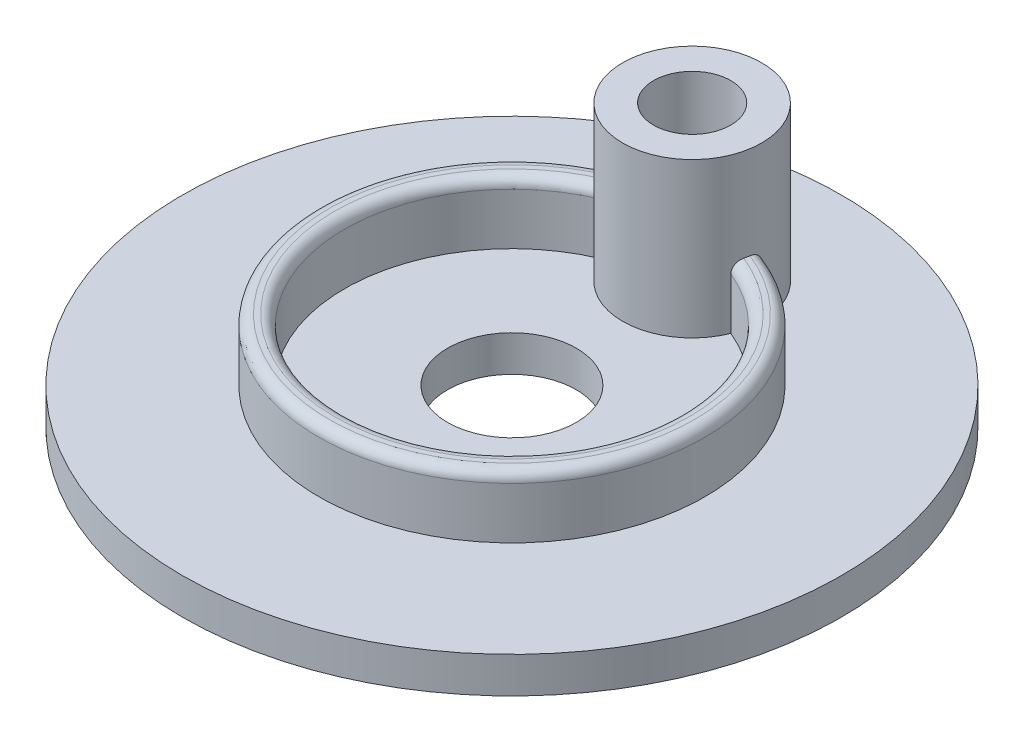
ISO-10303-21;
HEADER;
FILE_DESCRIPTION(('STEP AP214'),'2;1');
FILE_NAME('part.step','',(''),(''),'','','');
FILE_SCHEMA(('AUTOMOTIVE_DESIGN { 1 0 10303 214 1 1 1 1 }'));
ENDSEC;
DATA;
#1=APPLICATION_CONTEXT('core data for automotive mechanical design processes');
#2=APPLICATION_PROTOCOL_DEFINITION('international standard','automotive_design',2000,#1);
#3=PRODUCT_CONTEXT('',#1,'mechanical');
#4=PRODUCT('Part','Part','',(#3));
#5=PRODUCT_RELATED_PRODUCT_CATEGORY('part','',(#4));
#6=PRODUCT_DEFINITION_FORMATION('','',#4);
#7=PRODUCT_DEFINITION_CONTEXT('part definition',#1,'design');
#8=PRODUCT_DEFINITION('design','',#6,#7);
#9=PRODUCT_DEFINITION_SHAPE('','',#8);
#10=(LENGTH_UNIT() NAMED_UNIT(*) SI_UNIT(.MILLI.,.METRE.));
#11=(NAMED_UNIT(*) PLANE_ANGLE_UNIT() SI_UNIT($,.RADIAN.));
#12=(NAMED_UNIT(*) SI_UNIT($,.STERADIAN.) SOLID_ANGLE_UNIT());
#13=UNCERTAINTY_MEASURE_WITH_UNIT(LENGTH_MEASURE(1.E-05),#10,'distance_accuracy_value','');
#14=(GEOMETRIC_REPRESENTATION_CONTEXT(3) GLOBAL_UNCERTAINTY_ASSIGNED_CONTEXT((#13)) GLOBAL_UNIT_ASSIGNED_CONTEXT((#10,
#11,#12)) REPRESENTATION_CONTEXT('',''));
#15=CARTESIAN_POINT('',(0.,0.,0.));
#16=DIRECTION('',(0.,0.,1.));
#17=DIRECTION('',(1.,0.,0.));
#18=AXIS2_PLACEMENT_3D('',#15,#16,#17);
#19=CARTESIAN_POINT('',(0.,19.,0.));
#20=DIRECTION('',(0.,-1.,0.));
#21=DIRECTION('',(0.,0.,-1.));
#22=AXIS2_PLACEMENT_3D('',#19,#20,#21);
#23=CYLINDRICAL_SURFACE('',#22,37.5);
#24=DIRECTION('',(0.,-1.,0.));
#25=VECTOR('',#24,1.);
#26=CARTESIAN_POINT('',(13.4999924414189,22.,-34.9857142857143));
#27=LINE('',#26,#25);
#28=CARTESIAN_POINT('',(13.4999924414189,17.,-34.9857142857143));
#29=VERTEX_POINT('',#28);
#30=CARTESIAN_POINT('',(13.4999924414189,7.,-34.9857142857143));
#31=VERTEX_POINT('',#30);
#32=EDGE_CURVE('E173',#29,#31,#27,.T.);
#33=ORIENTED_EDGE('',*,*,#32,.F.);
#34=CARTESIAN_POINT('',(0.,17.,0.));
#35=DIRECTION('',(0.,1.,0.));
#36=DIRECTION('',(0.,0.,1.));
#37=AXIS2_PLACEMENT_3D('',#34,#35,#36);
#38=CIRCLE('',#37,37.5);
#39=CARTESIAN_POINT('',(-13.4999924414189,17.,-34.9857142857143));
#40=VERTEX_POINT('',#39);
#41=EDGE_CURVE('E130',#29,#40,#38,.F.);
#42=ORIENTED_EDGE('',*,*,#41,.T.);
#43=DIRECTION('',(0.,-1.,0.));
#44=VECTOR('',#43,1.);
#45=CARTESIAN_POINT('',(-13.4999924414189,22.,-34.9857142857143));
#46=LINE('',#45,#44);
#47=CARTESIAN_POINT('',(-13.4999924414189,7.,-34.9857142857143));
#48=VERTEX_POINT('',#47);
#49=EDGE_CURVE('E60',#48,#40,#46,.F.);
#50=ORIENTED_EDGE('',*,*,#49,.F.);
#51=CARTESIAN_POINT('',(0.,7.,0.));
#52=DIRECTION('',(0.,1.,0.));
#53=DIRECTION('',(0.,0.,1.));
#54=AXIS2_PLACEMENT_3D('',#51,#52,#53);
#55=CIRCLE('',#54,37.5);
#56=EDGE_CURVE('E178',#48,#31,#55,.T.);
#57=ORIENTED_EDGE('',*,*,#56,.T.);
#58=EDGE_LOOP('',(#33,#42,#50,#57));
#59=FACE_BOUND('',#58,.T.);
#60=ADVANCED_FACE('F39',(#59),#23,.T.);
#61=CARTESIAN_POINT('',(0.,19.,0.));
#62=DIRECTION('',(0.,-1.,0.));
#63=DIRECTION('',(0.,0.,-1.));
#64=AXIS2_PLACEMENT_3D('',#61,#62,#63);
#65=CYLINDRICAL_SURFACE('',#64,32.5);
#66=CARTESIAN_POINT('',(0.,17.,0.));
#67=DIRECTION('',(0.,1.,0.));
#68=DIRECTION('',(0.,0.,1.));
#69=AXIS2_PLACEMENT_3D('',#66,#67,#68);
#70=CIRCLE('',#69,32.5);
#71=CARTESIAN_POINT('',(-12.5342306814383,17.,-29.9857142857143));
#72=VERTEX_POINT('',#71);
#73=CARTESIAN_POINT('',(12.5342306814383,17.,-29.9857142857143));
#74=VERTEX_POINT('',#73);
#75=EDGE_CURVE('E111',#72,#74,#70,.T.);
#76=ORIENTED_EDGE('',*,*,#75,.T.);
#77=DIRECTION('',(0.,-1.,0.));
#78=VECTOR('',#77,1.);
#79=CARTESIAN_POINT('',(12.5342306814383,22.,-29.9857142857143));
#80=LINE('',#79,#78);
#81=CARTESIAN_POINT('',(12.5342306814383,7.,-29.9857142857143));
#82=VERTEX_POINT('',#81);
#83=EDGE_CURVE('E67',#74,#82,#80,.T.);
#84=ORIENTED_EDGE('',*,*,#83,.T.);
#85=CARTESIAN_POINT('',(0.,7.,0.));
#86=DIRECTION('',(0.,1.,0.));
#87=DIRECTION('',(0.,0.,1.));
#88=AXIS2_PLACEMENT_3D('',#85,#86,#87);
#89=CIRCLE('',#88,32.5);
#90=CARTESIAN_POINT('',(-12.5342306814383,7.,-29.9857142857143));
#91=VERTEX_POINT('',#90);
#92=EDGE_CURVE('E109',#82,#91,#89,.F.);
#93=ORIENTED_EDGE('',*,*,#92,.T.);
#94=DIRECTION('',(0.,-1.,0.));
#95=VECTOR('',#94,1.);
#96=CARTESIAN_POINT('',(-12.5342306814383,22.,-29.9857142857143));
#97=LINE('',#96,#95);
#98=EDGE_CURVE('E99',#91,#72,#97,.F.);
#99=ORIENTED_EDGE('',*,*,#98,.T.);
#100=EDGE_LOOP('',(#76,#84,#93,#99));
#101=FACE_BOUND('',#100,.T.);
#102=ADVANCED_FACE('F108',(#101),#65,.F.);
#103=CARTESIAN_POINT('',(0.,17.,0.));
#104=DIRECTION('',(0.,1.,0.));
#105=DIRECTION('',(0.,0.,1.));
#106=AXIS2_PLACEMENT_3D('',#103,#104,#105);
#107=TOROIDAL_SURFACE('',#106,34.5,2.);
#108=CARTESIAN_POINT('',(0.,19.,0.));
#109=DIRECTION('',(0.,1.,0.));
#110=DIRECTION('',(0.,0.,1.));
#111=AXIS2_PLACEMENT_3D('',#108,#109,#110);
#112=CIRCLE('',#111,34.5);
#113=CARTESIAN_POINT('',(13.1392541645255,19.,-31.9));
#114=VERTEX_POINT('',#113);
#115=CARTESIAN_POINT('',(-13.1392541645255,19.,-31.9));
#116=VERTEX_POINT('',#115);
#117=EDGE_CURVE('E127',#114,#116,#112,.F.);
#118=ORIENTED_EDGE('',*,*,#117,.F.);
#119=CARTESIAN_POINT('',(13.4574158289762,16.9998,-33.9285714181429));
#120=CARTESIAN_POINT('',(13.4574144173344,17.0545056757267,-33.928578843322));
#121=CARTESIAN_POINT('',(13.4572304603151,17.1091844471926,-33.9262404796411));
#122=CARTESIAN_POINT('',(13.4564838598886,17.218131998119,-33.9169142550499));
#123=CARTESIAN_POINT('',(13.4559212822476,17.2724008471276,-33.909927201617));
#124=CARTESIAN_POINT('',(13.4536498283262,17.4337539396021,-33.8821122901966));
#125=CARTESIAN_POINT('',(13.4513573831885,17.5397269979853,-33.8544301241502));
#126=CARTESIAN_POINT('',(13.4449784553747,17.7454532895092,-33.7818612507831));
#127=CARTESIAN_POINT('',(13.4408922087323,17.8452073389934,-33.7369768070862));
#128=CARTESIAN_POINT('',(13.4305739973357,18.0360152113749,-33.6316159779949));
#129=CARTESIAN_POINT('',(13.4243414211031,18.1270665454586,-33.571135150505));
#130=CARTESIAN_POINT('',(13.4091580731518,18.3002378827599,-33.434986634043));
#131=CARTESIAN_POINT('',(13.4001470188815,18.3820985500734,-33.358996233747));
#132=CARTESIAN_POINT('',(13.3790574540853,18.5324223858058,-33.195106525718));
#133=CARTESIAN_POINT('',(13.3669781511551,18.6008820851978,-33.1072041443426));
#134=CARTESIAN_POINT('',(13.3389501789862,18.7249333065295,-32.9187045171992));
#135=CARTESIAN_POINT('',(13.3228792968959,18.7799813003279,-32.8177672257079));
#136=CARTESIAN_POINT('',(13.2869546411496,18.8724741931693,-32.6087507538406));
#137=CARTESIAN_POINT('',(13.2671007797468,18.9099186838267,-32.5006714078416));
#138=CARTESIAN_POINT('',(13.2235226881637,18.9663246851704,-32.27947523551));
#139=CARTESIAN_POINT('',(13.199765923008,18.9851205740949,-32.1663224372503));
#140=CARTESIAN_POINT('',(13.148955175443,19.0029067051528,-31.9391973925251));
#141=CARTESIAN_POINT('',(13.1219014478561,19.0018984769831,-31.8252252100297));
#142=CARTESIAN_POINT('',(13.0657951446087,18.9800619834496,-31.6017579153184));
#143=CARTESIAN_POINT('',(13.0367840589503,18.9595688464566,-31.4922196959342));
#144=CARTESIAN_POINT('',(12.9774833344311,18.8996437962992,-31.2788182771367));
#145=CARTESIAN_POINT('',(12.9471938470116,18.860214120672,-31.1749544088578));
#146=CARTESIAN_POINT('',(12.8872987906026,18.7643786442,-30.9778171956945));
#147=CARTESIAN_POINT('',(12.8576912505481,18.7083130983703,-30.8843788804021));
#148=CARTESIAN_POINT('',(12.8000270425148,18.5804967058315,-30.7083925629165));
#149=CARTESIAN_POINT('',(12.7719702647317,18.5087469714537,-30.6258437890961));
#150=CARTESIAN_POINT('',(12.7190529410507,18.3520954903509,-30.4742834044056));
#151=CARTESIAN_POINT('',(12.6941733633002,18.2672794943705,-30.4051897454779));
#152=CARTESIAN_POINT('',(12.6487563939327,18.0865340347076,-30.2815985996307));
#153=CARTESIAN_POINT('',(12.6282201963043,17.9906015263017,-30.2271051251847));
#154=CARTESIAN_POINT('',(12.5926014063199,17.7900514594601,-30.133903341536));
#155=CARTESIAN_POINT('',(12.5775365423574,17.6854069950348,-30.0952462951689));
#156=CARTESIAN_POINT('',(12.5538444995709,17.4707146581686,-30.0349164781093));
#157=CARTESIAN_POINT('',(12.5452089055412,17.3606740505973,-30.0132215040611));
#158=CARTESIAN_POINT('',(12.5380973871844,17.2081290268839,-29.9953891622806));
#159=CARTESIAN_POINT('',(12.5366460719681,17.1665205228256,-29.9917556546748));
#160=CARTESIAN_POINT('',(12.534713044891,17.0832139548519,-29.9869194799736));
#161=CARTESIAN_POINT('',(12.5342296203805,17.0415161800581,-29.98571251917));
#162=CARTESIAN_POINT('',(12.5342306851531,16.9998,-29.985714295));
#163=B_SPLINE_CURVE_WITH_KNOTS('',3,(#119,#120,#121,#122,#123,#124,#125,#126,#127,#128,#129,
#130,#131,#132,#133,#134,#135,#136,#137,#138,#139,#140,#141,#142,#143,#144,#145,#146,#147,#148,
#149,#150,#151,#152,#153,#154,#155,#156,#157,#158,#159,#160,#161,#162),.UNSPECIFIED.,.F.,.F.,(4,
2,2,2,2,2,2,2,2,2,2,2,2,2,2,2,2,2,2,2,2,4),(0.,0.164013114976911,0.327997748307102,
0.654953654600703,0.98186655198686,1.30887266234879,1.64354277639147,1.97829941020852,
2.32494805147729,2.67160473428877,3.02131329684437,3.37099484753967,3.71476886214648,
4.05850226648402,4.39564011551689,4.73275406229653,5.06774310429607,5.40282411493564,
5.7389813783424,6.07469787165953,6.20001093474513,6.32510206394407),.UNSPECIFIED.);
#164=EDGE_CURVE('E113',#114,#74,#163,.T.);
#165=ORIENTED_EDGE('',*,*,#164,.T.);
#166=ORIENTED_EDGE('',*,*,#75,.F.);
#167=CARTESIAN_POINT('',(-12.5342306851531,16.9998,-29.985714295));
#168=CARTESIAN_POINT('',(-12.5342268697503,17.0560370969131,-29.9857102014814));
#169=CARTESIAN_POINT('',(-12.5351083889939,17.112247504364,-29.9879076817219));
#170=CARTESIAN_POINT('',(-12.5386171632372,17.2242670653584,-29.9966898332425));
#171=CARTESIAN_POINT('',(-12.5412443393752,17.2800762369129,-30.0032743063356));
#172=CARTESIAN_POINT('',(-12.5516963952655,17.4462179749447,-30.0295577193439));
#173=CARTESIAN_POINT('',(-12.5620919513565,17.5554391168735,-30.0557867580812));
#174=CARTESIAN_POINT('',(-12.5891352216796,17.7675921308088,-30.125059934522));
#175=CARTESIAN_POINT('',(-12.6057859806872,17.8705209115369,-30.1681122615214));
#176=CARTESIAN_POINT('',(-12.6443687816386,18.0671541834741,-30.270000660939));
#177=CARTESIAN_POINT('',(-12.6662996704453,18.1608606824676,-30.3288332873889));
#178=CARTESIAN_POINT('',(-12.71417539284,18.3362806307703,-30.4607657656329));
#179=CARTESIAN_POINT('',(-12.7401156037068,18.4180076834803,-30.533849211402));
#180=CARTESIAN_POINT('',(-12.7946190182422,18.5672854145666,-30.6924783656644));
#181=CARTESIAN_POINT('',(-12.8231825229434,18.6348344630349,-30.7780255050751));
#182=CARTESIAN_POINT('',(-12.8813541023824,18.7536392468189,-30.9589970000832));
#183=CARTESIAN_POINT('',(-12.9109582246778,18.8049505009224,-31.0543861877352));
#184=CARTESIAN_POINT('',(-12.9699017117889,18.8902257582849,-31.2526892087434));
#185=CARTESIAN_POINT('',(-12.9992410969053,18.9241911029708,-31.3556024595304));
#186=CARTESIAN_POINT('',(-13.0564582511928,18.9739983135213,-31.5662246489553));
#187=CARTESIAN_POINT('',(-13.0843345102258,18.9898217924573,-31.673938338251));
#188=CARTESIAN_POINT('',(-13.1376245140699,19.003044226538,-31.8910896393815));
#189=CARTESIAN_POINT('',(-13.1630380273819,19.0004414513077,-32.0005274121589));
#190=CARTESIAN_POINT('',(-13.2110676270142,18.9769229859204,-32.219632337999));
#191=CARTESIAN_POINT('',(-13.2336403826622,18.955755665444,-32.3292819056834));
#192=CARTESIAN_POINT('',(-13.2752139476901,18.8955084731271,-32.5442532211605));
#193=CARTESIAN_POINT('',(-13.2942142818322,18.8564262204455,-32.6495743916944));
#194=CARTESIAN_POINT('',(-13.3289403736964,18.7604541276025,-32.8551346096964));
#195=CARTESIAN_POINT('',(-13.3445886847945,18.7032063677102,-32.955219782195));
#196=CARTESIAN_POINT('',(-13.3722800261321,18.5727080043764,-33.1449178755092));
#197=CARTESIAN_POINT('',(-13.3843228762751,18.4994566018528,-33.234530273063));
#198=CARTESIAN_POINT('',(-13.4052345081904,18.33832263572,-33.4010060902396));
#199=CARTESIAN_POINT('',(-13.414083447063,18.2503534113501,-33.477788269201));
#200=CARTESIAN_POINT('',(-13.4289759312037,18.0623815166404,-33.6152952852834));
#201=CARTESIAN_POINT('',(-13.4350190162139,17.962376875458,-33.6760174873054));
#202=CARTESIAN_POINT('',(-13.4446552025307,17.7557533375156,-33.7777863466095));
#203=CARTESIAN_POINT('',(-13.4483045398741,17.6493556567674,-33.819277356271));
#204=CARTESIAN_POINT('',(-13.4537482819707,17.430997184884,-33.8829946601765));
#205=CARTESIAN_POINT('',(-13.455546165058,17.3190472412716,-33.9052570665295));
#206=CARTESIAN_POINT('',(-13.456824590558,17.1718751733412,-33.9211695182661));
#207=CARTESIAN_POINT('',(-13.4570470543442,17.1374912362917,-33.9239491880648));
#208=CARTESIAN_POINT('',(-13.4573426123094,17.0686765089656,-33.9276493397925));
#209=CARTESIAN_POINT('',(-13.4574159386702,17.0342458751527,-33.9285727116391));
#210=CARTESIAN_POINT('',(-13.4574158289763,16.9998,-33.9285714181432));
#211=B_SPLINE_CURVE_WITH_KNOTS('',3,(#167,#168,#169,#170,#171,#172,#173,#174,#175,#176,#177,
#178,#179,#180,#181,#182,#183,#184,#185,#186,#187,#188,#189,#190,#191,#192,#193,#194,#195,#196,
#197,#198,#199,#200,#201,#202,#203,#204,#205,#206,#207,#208,#209,#210),.UNSPECIFIED.,.F.,.F.,(4,
2,2,2,2,2,2,2,2,2,2,2,2,2,2,2,2,2,2,2,2,4),(0.,0.168607732966097,0.337207849425625,
0.673891678436985,1.01073960408894,1.34751403154103,1.68390301780707,2.02033065430595,
2.35559525892231,2.6908339322903,3.02641207326334,3.36202172817174,3.70225190011525,
4.04252730075171,4.3899736564934,4.73743736463633,5.08702405062106,5.43666806077358,
5.77777195553727,6.11823384149522,6.221689479048,6.32498392991242),.UNSPECIFIED.);
#212=EDGE_CURVE('E149',#72,#116,#211,.T.);
#213=ORIENTED_EDGE('',*,*,#212,.T.);
#214=EDGE_LOOP('',(#118,#165,#166,#213));
#215=FACE_BOUND('',#214,.T.);
#216=ADVANCED_FACE('F160',(#215),#107,.T.);
#217=CARTESIAN_POINT('',(0.,17.,0.));
#218=DIRECTION('',(0.,1.,0.));
#219=DIRECTION('',(0.,0.,1.));
#220=AXIS2_PLACEMENT_3D('',#217,#218,#219);
#221=TOROIDAL_SURFACE('',#220,35.5,2.);
#222=ORIENTED_EDGE('',*,*,#41,.F.);
#223=CARTESIAN_POINT('',(13.4999924414076,16.9998,-34.985714275));
#224=CARTESIAN_POINT('',(13.4999899547307,17.0536329745252,-34.9857287238921));
#225=CARTESIAN_POINT('',(13.4999899276816,17.1074619317858,-34.9833972496276));
#226=CARTESIAN_POINT('',(13.4999766332635,17.2147073111454,-34.9741090601479));
#227=CARTESIAN_POINT('',(13.4999633689337,17.2681238250999,-34.9671534067124));
#228=CARTESIAN_POINT('',(13.499905538721,17.3740132564129,-34.9487098217433));
#229=CARTESIAN_POINT('',(13.4998610624664,17.4264884354747,-34.937234909009));
#230=CARTESIAN_POINT('',(13.4997061356343,17.5302664603213,-34.909888940599));
#231=CARTESIAN_POINT('',(13.4995956834144,17.5815692768869,-34.8940177754833));
#232=CARTESIAN_POINT('',(13.4991009478815,17.7331455080814,-34.8400511133429));
#233=CARTESIAN_POINT('',(13.4985534243507,17.8312261073027,-34.7955777571894));
#234=CARTESIAN_POINT('',(13.496571460751,18.018849826176,-34.6913604325385));
#235=CARTESIAN_POINT('',(13.495136596677,18.1083888407102,-34.631609171687));
#236=CARTESIAN_POINT('',(13.4907851678145,18.2798138791902,-34.4965933977191));
#237=CARTESIAN_POINT('',(13.487820341785,18.361340728843,-34.4208742995195));
#238=CARTESIAN_POINT('',(13.4798195699396,18.5114209090165,-34.2576123285346));
#239=CARTESIAN_POINT('',(13.4747829919531,18.5799702702788,-34.1700658522452));
#240=CARTESIAN_POINT('',(13.461787763825,18.7061809248193,-33.9802904275848));
#241=CARTESIAN_POINT('',(13.4536786481031,18.7629967187266,-33.8775084744869));
#242=CARTESIAN_POINT('',(13.434191708356,18.8591602094536,-33.664356522181));
#243=CARTESIAN_POINT('',(13.4228134558381,18.8985056146712,-33.5539855297053));
#244=CARTESIAN_POINT('',(13.3963056625503,18.9593530414738,-33.3259413135855));
#245=CARTESIAN_POINT('',(13.3810921218905,18.980400937157,-33.2081560858591));
#246=CARTESIAN_POINT('',(13.347220150079,19.0021669054666,-32.971199584585));
#247=CARTESIAN_POINT('',(13.3285619207529,19.0028861687747,-32.8520283926245));
#248=CARTESIAN_POINT('',(13.2886712580937,18.9837814867689,-32.6177506991559));
#249=CARTESIAN_POINT('',(13.2674849557477,18.9642871303243,-32.5026096575149));
#250=CARTESIAN_POINT('',(13.2232074306106,18.9054833668645,-32.2778868322746));
#251=CARTESIAN_POINT('',(13.2001165658804,18.8661776773439,-32.1683040099483));
#252=CARTESIAN_POINT('',(13.1539706322896,18.7701503779794,-31.9612532947442));
#253=CARTESIAN_POINT('',(13.1309357892816,18.7139941660639,-31.8635184821903));
#254=CARTESIAN_POINT('',(13.0855537030355,18.5853813846498,-31.6792624018784));
#255=CARTESIAN_POINT('',(13.0632063616116,18.5129271551624,-31.5927395271582));
#256=CARTESIAN_POINT('',(13.021011075757,18.3553202712599,-31.4349149209358));
#257=CARTESIAN_POINT('',(13.001123090462,18.2704408857248,-31.3633507303774));
#258=CARTESIAN_POINT('',(12.9646110233555,18.0893501575886,-31.2352539998953));
#259=CARTESIAN_POINT('',(12.9479876844063,17.993136243793,-31.1787248801307));
#260=CARTESIAN_POINT('',(12.9191651259513,17.7926024562649,-31.0823859589683));
#261=CARTESIAN_POINT('',(12.9069472904254,17.688319007875,-31.0425056901417));
#262=CARTESIAN_POINT('',(12.8876599780105,17.4742977638884,-30.9801366129713));
#263=CARTESIAN_POINT('',(12.8805838414646,17.3645672211266,-30.9576253055681));
#264=CARTESIAN_POINT('',(12.8746783416316,17.2116227676772,-30.9388825083058));
#265=CARTESIAN_POINT('',(12.8734558295233,17.1693203162385,-30.9350102083425));
#266=CARTESIAN_POINT('',(12.871827208792,17.0846180119705,-30.9298560310052));
#267=CARTESIAN_POINT('',(12.8714196463463,17.0422184679216,-30.9285695406765));
#268=CARTESIAN_POINT('',(12.8714206467543,16.9998,-30.9285714381429));
#269=B_SPLINE_CURVE_WITH_KNOTS('',3,(#223,#224,#225,#226,#227,#228,#229,#230,#231,#232,#233,
#234,#235,#236,#237,#238,#239,#240,#241,#242,#243,#244,#245,#246,#247,#248,#249,#250,#251,#252,
#253,#254,#255,#256,#257,#258,#259,#260,#261,#262,#263,#264,#265,#266,#267,#268),.UNSPECIFIED.,
.F.,.F.,(4,2,2,2,2,2,2,2,2,2,2,2,2,2,2,2,2,2,2,2,2,2,4),(0.,0.161440946562061,0.322844836699355,
0.4837871262088,0.644733422571578,0.966206653779078,1.28783361596148,1.62028953473868,
1.95284697385498,2.30439862484178,2.65599637547557,3.01608986065854,3.37616225452467,
3.73045450987586,4.08468030884758,4.4281442754682,4.77155896019543,5.10831913809362,
5.44515585638527,5.78055206976081,6.11551309145407,6.24293635038863,6.37013209013873),.UNSPECIFIED.);
#270=CARTESIAN_POINT('',(13.3356664625358,19.0000000000003,-32.9));
#271=VERTEX_POINT('',#270);
#272=EDGE_CURVE('E11',#29,#271,#269,.T.);
#273=ORIENTED_EDGE('',*,*,#272,.T.);
#274=CARTESIAN_POINT('',(0.,19.,0.));
#275=DIRECTION('',(0.,1.,0.));
#276=DIRECTION('',(0.,0.,1.));
#277=AXIS2_PLACEMENT_3D('',#274,#275,#276);
#278=CIRCLE('',#277,35.5);
#279=CARTESIAN_POINT('',(-13.3356664625357,19.,-32.9));
#280=VERTEX_POINT('',#279);
#281=EDGE_CURVE('E118',#280,#271,#278,.T.);
#282=ORIENTED_EDGE('',*,*,#281,.F.);
#283=CARTESIAN_POINT('',(-12.8714206467543,16.9998,-30.9285714381429));
#284=CARTESIAN_POINT('',(-12.8714171743057,17.0558214967457,-30.9285671117731));
#285=CARTESIAN_POINT('',(-12.8721305543787,17.1118164220704,-30.9308149912982));
#286=CARTESIAN_POINT('',(-12.8749675988924,17.2234066950352,-30.939797781384));
#287=CARTESIAN_POINT('',(-12.8770912019435,17.2790020599623,-30.9465324966247));
#288=CARTESIAN_POINT('',(-12.8855335680313,17.4445051202344,-30.9734132797008));
#289=CARTESIAN_POINT('',(-12.8939240290957,17.5533057994145,-31.000236100277));
#290=CARTESIAN_POINT('',(-12.915676852192,17.7646422109985,-31.0710501117122));
#291=CARTESIAN_POINT('',(-12.9290416876298,17.8671747971435,-31.1150498439719));
#292=CARTESIAN_POINT('',(-12.959854702327,18.0630504522336,-31.2191140166693));
#293=CARTESIAN_POINT('',(-12.9773019302378,18.15639565499,-31.2791747147731));
#294=CARTESIAN_POINT('',(-13.0151360624063,18.3311882433863,-31.4137624534301));
#295=CARTESIAN_POINT('',(-13.0355205469729,18.4126453122822,-31.4882776038329));
#296=CARTESIAN_POINT('',(-13.0779722963667,18.5615029336063,-31.6498355186865));
#297=CARTESIAN_POINT('',(-13.1000397844668,18.6289016165566,-31.7368799466774));
#298=CARTESIAN_POINT('',(-13.1445807006417,18.7478921928802,-31.9212042880693));
#299=CARTESIAN_POINT('',(-13.1670545135254,18.7994681707984,-32.0184943759557));
#300=CARTESIAN_POINT('',(-13.211179960333,18.885468921686,-32.2205381664594));
#301=CARTESIAN_POINT('',(-13.2328316150369,18.919894128406,-32.3252916802467));
#302=CARTESIAN_POINT('',(-13.2745470953848,18.9712112273075,-32.5406187903204));
#303=CARTESIAN_POINT('',(-13.2945898754688,18.9878976183008,-32.6512453363155));
#304=CARTESIAN_POINT('',(-13.3320530902172,19.0028958857205,-32.8741726296029));
#305=CARTESIAN_POINT('',(-13.3494731052434,19.0012048249452,-32.9864736416547));
#306=CARTESIAN_POINT('',(-13.3816651815677,18.9794955424646,-33.2127034841558));
#307=CARTESIAN_POINT('',(-13.3963558738581,18.958998131587,-33.3265978338997));
#308=CARTESIAN_POINT('',(-13.4223692004177,18.899758718818,-33.5499448835898));
#309=CARTESIAN_POINT('',(-13.4336912048825,18.8610133088033,-33.6593967496773));
#310=CARTESIAN_POINT('',(-13.4533917435719,18.7650132139934,-33.8738686714077));
#311=CARTESIAN_POINT('',(-13.4616792875389,18.7072720320959,-33.9786797210964));
#312=CARTESIAN_POINT('',(-13.475283663668,18.5750700140086,-34.1774040742907));
#313=CARTESIAN_POINT('',(-13.4806003214898,18.5006081969627,-34.2713167379911));
#314=CARTESIAN_POINT('',(-13.4888780917181,18.3367250126292,-34.4452370704666));
#315=CARTESIAN_POINT('',(-13.4918386052043,18.2472998487193,-34.5252411997241));
#316=CARTESIAN_POINT('',(-13.496116703207,18.0557244362214,-34.6683666663511));
#317=CARTESIAN_POINT('',(-13.4974342192464,17.953573657449,-34.7314872999624));
#318=CARTESIAN_POINT('',(-13.4990980244909,17.7441677065437,-34.8357875529394));
#319=CARTESIAN_POINT('',(-13.4994841426285,17.6373290739777,-34.8778035801506));
#320=CARTESIAN_POINT('',(-13.4999141032593,17.4179477808811,-34.9419348001987));
#321=CARTESIAN_POINT('',(-13.4999586782838,17.3054178493464,-34.9640924943322));
#322=CARTESIAN_POINT('',(-13.4999838832169,17.1600431580398,-34.9791222671939));
#323=CARTESIAN_POINT('',(-13.4999874462015,17.1280198678336,-34.9815978651276));
#324=CARTESIAN_POINT('',(-13.4999917604785,17.0639357203313,-34.9848931565138));
#325=CARTESIAN_POINT('',(-13.4999925159285,17.0318749889722,-34.9857152976958));
#326=CARTESIAN_POINT('',(-13.4999924414076,16.9998,-34.9857142750002));
#327=B_SPLINE_CURVE_WITH_KNOTS('',3,(#283,#284,#285,#286,#287,#288,#289,#290,#291,#292,#293,
#294,#295,#296,#297,#298,#299,#300,#301,#302,#303,#304,#305,#306,#307,#308,#309,#310,#311,#312,
#313,#314,#315,#316,#317,#318,#319,#320,#321,#322,#323,#324,#325,#326),.UNSPECIFIED.,.F.,.F.,(4,
2,2,2,2,2,2,2,2,2,2,2,2,2,2,2,2,2,2,2,2,4),(0.,0.167961358496068,0.33591540581312,
0.671302160853763,1.00685590337051,1.34233152719845,1.67753235204671,2.01277772337907,
2.34835920790121,2.68393220498634,3.02335175297076,3.36282554995191,3.71119688037144,
4.05963330086135,4.41779638691247,4.7759804888081,5.13425561028377,5.49254566348779,
5.83521929617429,6.17715776665774,6.27348617197007,6.36967187022839),.UNSPECIFIED.);
#328=EDGE_CURVE('E53',#280,#40,#327,.T.);
#329=ORIENTED_EDGE('',*,*,#328,.T.);
#330=EDGE_LOOP('',(#222,#273,#282,#329));
#331=FACE_BOUND('',#330,.T.);
#332=ADVANCED_FACE('F41',(#331),#221,.T.);
#333=CARTESIAN_POINT('',(0.,7.,0.));
#334=DIRECTION('',(0.,-1.,0.));
#335=DIRECTION('',(0.,0.,-1.));
#336=AXIS2_PLACEMENT_3D('',#333,#334,#335);
#337=CYLINDRICAL_SURFACE('',#336,64.);
#338=CARTESIAN_POINT('',(0.,7.,0.));
#339=DIRECTION('',(0.,1.,0.));
#340=DIRECTION('',(0.,0.,1.));
#341=AXIS2_PLACEMENT_3D('',#338,#339,#340);
#342=CIRCLE('',#341,64.);
#343=CARTESIAN_POINT('',(0.,7.,64.));
#344=VERTEX_POINT('',#343);
#345=EDGE_CURVE('E116',#344,#344,#342,.T.);
#346=ORIENTED_EDGE('',*,*,#345,.F.);
#347=EDGE_LOOP('',(#346));
#348=FACE_BOUND('',#347,.T.);
#349=CARTESIAN_POINT('',(0.,0.,0.));
#350=DIRECTION('',(0.,1.,0.));
#351=DIRECTION('',(0.,0.,1.));
#352=AXIS2_PLACEMENT_3D('',#349,#350,#351);
#353=CIRCLE('',#352,64.);
#354=CARTESIAN_POINT('',(0.,0.,64.));
#355=VERTEX_POINT('',#354);
#356=EDGE_CURVE('E121',#355,#355,#353,.T.);
#357=ORIENTED_EDGE('',*,*,#356,.T.);
#358=EDGE_LOOP('',(#357));
#359=FACE_BOUND('',#358,.T.);
#360=ADVANCED_FACE('F165',(#348,#359),#337,.T.);
#361=CARTESIAN_POINT('',(0.,7.,0.));
#362=DIRECTION('',(0.,1.,0.));
#363=DIRECTION('',(0.,0.,1.));
#364=AXIS2_PLACEMENT_3D('',#361,#362,#363);
#365=PLANE('',#364);
#366=ORIENTED_EDGE('',*,*,#56,.F.);
#367=CARTESIAN_POINT('',(0.,7.,-35.));
#368=DIRECTION('',(0.,1.,0.));
#369=DIRECTION('',(0.,0.,1.));
#370=AXIS2_PLACEMENT_3D('',#367,#368,#369);
#371=CIRCLE('',#370,13.5);
#372=EDGE_CURVE('E103',#31,#48,#371,.T.);
#373=ORIENTED_EDGE('',*,*,#372,.F.);
#374=EDGE_LOOP('',(#366,#373));
#375=FACE_BOUND('',#374,.T.);
#376=ORIENTED_EDGE('',*,*,#345,.T.);
#377=EDGE_LOOP('',(#376));
#378=FACE_BOUND('',#377,.T.);
#379=ADVANCED_FACE('F192',(#375,#378),#365,.T.);
#380=CARTESIAN_POINT('',(0.,0.,0.));
#381=DIRECTION('',(0.,1.,0.));
#382=DIRECTION('',(0.,0.,1.));
#383=AXIS2_PLACEMENT_3D('',#380,#381,#382);
#384=PLANE('',#383);
#385=CARTESIAN_POINT('',(0.,0.,-35.));
#386=DIRECTION('',(0.,1.,0.));
#387=DIRECTION('',(0.,0.,1.));
#388=AXIS2_PLACEMENT_3D('',#385,#386,#387);
#389=CIRCLE('',#388,7.5);
#390=CARTESIAN_POINT('',(0.,0.,-27.5));
#391=VERTEX_POINT('',#390);
#392=EDGE_CURVE('E104',#391,#391,#389,.T.);
#393=ORIENTED_EDGE('',*,*,#392,.T.);
#394=EDGE_LOOP('',(#393));
#395=FACE_BOUND('',#394,.T.);
#396=CARTESIAN_POINT('',(0.,0.,0.));
#397=DIRECTION('',(0.,1.,0.));
#398=DIRECTION('',(0.,0.,1.));
#399=AXIS2_PLACEMENT_3D('',#396,#397,#398);
#400=CIRCLE('',#399,12.5);
#401=CARTESIAN_POINT('',(0.,0.,12.5));
#402=VERTEX_POINT('',#401);
#403=EDGE_CURVE('E175',#402,#402,#400,.T.);
#404=ORIENTED_EDGE('',*,*,#403,.T.);
#405=EDGE_LOOP('',(#404));
#406=FACE_BOUND('',#405,.T.);
#407=ORIENTED_EDGE('',*,*,#356,.F.);
#408=EDGE_LOOP('',(#407));
#409=FACE_BOUND('',#408,.T.);
#410=ADVANCED_FACE('F189',(#395,#406,#409),#384,.F.);
#411=CARTESIAN_POINT('',(0.,19.,0.));
#412=DIRECTION('',(0.,1.,0.));
#413=DIRECTION('',(0.,0.,1.));
#414=AXIS2_PLACEMENT_3D('',#411,#412,#413);
#415=PLANE('',#414);
#416=ORIENTED_EDGE('',*,*,#117,.T.);
#417=CARTESIAN_POINT('',(0.,19.,-35.));
#418=DIRECTION('',(0.,1.,0.));
#419=DIRECTION('',(0.,0.,1.));
#420=AXIS2_PLACEMENT_3D('',#417,#418,#419);
#421=CIRCLE('',#420,13.5);
#422=EDGE_CURVE('E157',#116,#280,#421,.F.);
#423=ORIENTED_EDGE('',*,*,#422,.T.);
#424=ORIENTED_EDGE('',*,*,#281,.T.);
#425=EDGE_CURVE('E172',#271,#114,#421,.F.);
#426=ORIENTED_EDGE('',*,*,#425,.T.);
#427=EDGE_LOOP('',(#416,#423,#424,#426));
#428=FACE_BOUND('',#427,.T.);
#429=ADVANCED_FACE('F191',(#428),#415,.T.);
#430=CARTESIAN_POINT('',(0.,7.,0.));
#431=DIRECTION('',(0.,1.,0.));
#432=DIRECTION('',(0.,0.,1.));
#433=AXIS2_PLACEMENT_3D('',#430,#431,#432);
#434=CIRCLE('',#433,12.5);
#435=CARTESIAN_POINT('',(0.,7.,12.5));
#436=VERTEX_POINT('',#435);
#437=EDGE_CURVE('E112',#436,#436,#434,.T.);
#438=ORIENTED_EDGE('',*,*,#437,.F.);
#439=EDGE_LOOP('',(#438));
#440=FACE_BOUND('',#439,.T.);
#441=ORIENTED_EDGE('',*,*,#92,.F.);
#442=EDGE_CURVE('E95',#91,#82,#371,.T.);
#443=ORIENTED_EDGE('',*,*,#442,.F.);
#444=EDGE_LOOP('',(#441,#443));
#445=FACE_BOUND('',#444,.T.);
#446=ADVANCED_FACE('F115',(#440,#445),#365,.T.);
#447=CARTESIAN_POINT('',(0.,0.,0.));
#448=DIRECTION('',(0.,1.,0.));
#449=DIRECTION('',(0.,0.,1.));
#450=AXIS2_PLACEMENT_3D('',#447,#448,#449);
#451=CYLINDRICAL_SURFACE('',#450,12.5);
#452=ORIENTED_EDGE('',*,*,#403,.F.);
#453=EDGE_LOOP('',(#452));
#454=FACE_BOUND('',#453,.T.);
#455=ORIENTED_EDGE('',*,*,#437,.T.);
#456=EDGE_LOOP('',(#455));
#457=FACE_BOUND('',#456,.T.);
#458=ADVANCED_FACE('F141',(#454,#457),#451,.F.);
#459=CARTESIAN_POINT('',(0.,37.,-35.));
#460=DIRECTION('',(0.,-1.,0.));
#461=DIRECTION('',(0.,0.,-1.));
#462=AXIS2_PLACEMENT_3D('',#459,#460,#461);
#463=CYLINDRICAL_SURFACE('',#462,13.5);
#464=ORIENTED_EDGE('',*,*,#83,.F.);
#465=ORIENTED_EDGE('',*,*,#164,.F.);
#466=ORIENTED_EDGE('',*,*,#425,.F.);
#467=ORIENTED_EDGE('',*,*,#272,.F.);
#468=ORIENTED_EDGE('',*,*,#32,.T.);
#469=ORIENTED_EDGE('',*,*,#372,.T.);
#470=ORIENTED_EDGE('',*,*,#49,.T.);
#471=ORIENTED_EDGE('',*,*,#328,.F.);
#472=ORIENTED_EDGE('',*,*,#422,.F.);
#473=ORIENTED_EDGE('',*,*,#212,.F.);
#474=ORIENTED_EDGE('',*,*,#98,.F.);
#475=ORIENTED_EDGE('',*,*,#442,.T.);
#476=EDGE_LOOP('',(#464,#465,#466,#467,#468,#469,#470,#471,#472,#473,#474,#475));
#477=FACE_BOUND('',#476,.T.);
#478=CARTESIAN_POINT('',(0.,37.,-35.));
#479=DIRECTION('',(0.,1.,0.));
#480=DIRECTION('',(0.,0.,1.));
#481=AXIS2_PLACEMENT_3D('',#478,#479,#480);
#482=CIRCLE('',#481,13.5);
#483=CARTESIAN_POINT('',(0.,37.,-21.5));
#484=VERTEX_POINT('',#483);
#485=EDGE_CURVE('E218',#484,#484,#482,.T.);
#486=ORIENTED_EDGE('',*,*,#485,.F.);
#487=EDGE_LOOP('',(#486));
#488=FACE_BOUND('',#487,.T.);
#489=ADVANCED_FACE('F96',(#477,#488),#463,.T.);
#490=CARTESIAN_POINT('',(0.,37.,-35.));
#491=DIRECTION('',(0.,1.,0.));
#492=DIRECTION('',(0.,0.,1.));
#493=AXIS2_PLACEMENT_3D('',#490,#491,#492);
#494=PLANE('',#493);
#495=CARTESIAN_POINT('',(0.,37.,-35.));
#496=DIRECTION('',(0.,1.,0.));
#497=DIRECTION('',(0.,0.,1.));
#498=AXIS2_PLACEMENT_3D('',#495,#496,#497);
#499=CIRCLE('',#498,7.5);
#500=CARTESIAN_POINT('',(0.,37.,-27.5));
#501=VERTEX_POINT('',#500);
#502=EDGE_CURVE('E222',#501,#501,#499,.T.);
#503=ORIENTED_EDGE('',*,*,#502,.F.);
#504=EDGE_LOOP('',(#503));
#505=FACE_BOUND('',#504,.T.);
#506=ORIENTED_EDGE('',*,*,#485,.T.);
#507=EDGE_LOOP('',(#506));
#508=FACE_BOUND('',#507,.T.);
#509=ADVANCED_FACE('F140',(#505,#508),#494,.T.);
#510=CARTESIAN_POINT('',(0.,0.,-35.));
#511=DIRECTION('',(0.,1.,0.));
#512=DIRECTION('',(0.,0.,1.));
#513=AXIS2_PLACEMENT_3D('',#510,#511,#512);
#514=CYLINDRICAL_SURFACE('',#513,7.5);
#515=ORIENTED_EDGE('',*,*,#392,.F.);
#516=EDGE_LOOP('',(#515));
#517=FACE_BOUND('',#516,.T.);
#518=ORIENTED_EDGE('',*,*,#502,.T.);
#519=EDGE_LOOP('',(#518));
#520=FACE_BOUND('',#519,.T.);
#521=ADVANCED_FACE('F227',(#517,#520),#514,.F.);
#522=CLOSED_SHELL('',(#60,#102,#216,#332,#360,#379,#410,#429,#446,#458,#489,#509,#521));
#523=MANIFOLD_SOLID_BREP('B2',#522);
#524=ADVANCED_BREP_SHAPE_REPRESENTATION('',(#18,#523),#14);
#525=SHAPE_DEFINITION_REPRESENTATION(#9,#524);
ENDSEC;
END-ISO-10303-21;
